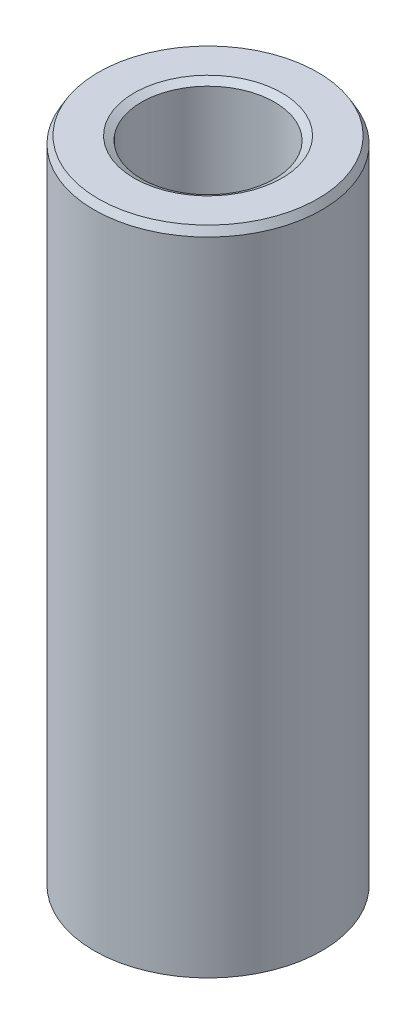
ISO-10303-21;
HEADER;
FILE_DESCRIPTION(('STEP AP214'),'2;1');
FILE_NAME('part.step','',(''),(''),'','','');
FILE_SCHEMA(('AUTOMOTIVE_DESIGN { 1 0 10303 214 1 1 1 1 }'));
ENDSEC;
DATA;
#1=APPLICATION_CONTEXT('core data for automotive mechanical design processes');
#2=APPLICATION_PROTOCOL_DEFINITION('international standard','automotive_design',2000,#1);
#3=PRODUCT_CONTEXT('',#1,'mechanical');
#4=PRODUCT('Part','Part','',(#3));
#5=PRODUCT_RELATED_PRODUCT_CATEGORY('part','',(#4));
#6=PRODUCT_DEFINITION_FORMATION('','',#4);
#7=PRODUCT_DEFINITION_CONTEXT('part definition',#1,'design');
#8=PRODUCT_DEFINITION('design','',#6,#7);
#9=PRODUCT_DEFINITION_SHAPE('','',#8);
#10=(LENGTH_UNIT() NAMED_UNIT(*) SI_UNIT(.MILLI.,.METRE.));
#11=(NAMED_UNIT(*) PLANE_ANGLE_UNIT() SI_UNIT($,.RADIAN.));
#12=(NAMED_UNIT(*) SI_UNIT($,.STERADIAN.) SOLID_ANGLE_UNIT());
#13=UNCERTAINTY_MEASURE_WITH_UNIT(LENGTH_MEASURE(1.E-05),#10,'distance_accuracy_value','');
#14=(GEOMETRIC_REPRESENTATION_CONTEXT(3) GLOBAL_UNCERTAINTY_ASSIGNED_CONTEXT((#13)) GLOBAL_UNIT_ASSIGNED_CONTEXT((#10,
#11,#12)) REPRESENTATION_CONTEXT('',''));
#15=CARTESIAN_POINT('',(0.,0.,0.));
#16=DIRECTION('',(0.,0.,1.));
#17=DIRECTION('',(1.,0.,0.));
#18=AXIS2_PLACEMENT_3D('',#15,#16,#17);
#19=CARTESIAN_POINT('',(0.,172.003541324737,0.));
#20=DIRECTION('',(0.,-1.,0.));
#21=DIRECTION('',(0.,0.,-1.));
#22=AXIS2_PLACEMENT_3D('',#19,#20,#21);
#23=CYLINDRICAL_SURFACE('',#22,30.);
#24=CARTESIAN_POINT('',(0.,1.12327016512606,0.));
#25=DIRECTION('',(0.,1.,0.));
#26=DIRECTION('',(0.,0.,1.));
#27=AXIS2_PLACEMENT_3D('',#24,#25,#26);
#28=CIRCLE('',#27,30.);
#29=CARTESIAN_POINT('',(0.,1.12327016512606,30.));
#30=VERTEX_POINT('',#29);
#31=EDGE_CURVE('E10',#30,#30,#28,.T.);
#32=ORIENTED_EDGE('',*,*,#31,.T.);
#33=EDGE_LOOP('',(#32));
#34=FACE_BOUND('',#33,.T.);
#35=CARTESIAN_POINT('',(0.,170.057980328112,0.));
#36=DIRECTION('',(0.,1.,0.));
#37=DIRECTION('',(0.,0.,1.));
#38=AXIS2_PLACEMENT_3D('',#35,#36,#37);
#39=CIRCLE('',#38,30.);
#40=CARTESIAN_POINT('',(0.,170.057980328112,30.));
#41=VERTEX_POINT('',#40);
#42=EDGE_CURVE('E50',#41,#41,#39,.F.);
#43=ORIENTED_EDGE('',*,*,#42,.T.);
#44=EDGE_LOOP('',(#43));
#45=FACE_BOUND('',#44,.T.);
#46=ADVANCED_FACE('F39',(#34,#45),#23,.T.);
#47=CARTESIAN_POINT('',(0.,172.003541324737,0.));
#48=DIRECTION('',(0.,1.,0.));
#49=DIRECTION('',(0.,0.,1.));
#50=AXIS2_PLACEMENT_3D('',#47,#48,#49);
#51=PLANE('',#50);
#52=CARTESIAN_POINT('',(0.,172.003541324737,0.));
#53=DIRECTION('',(0.,1.,0.));
#54=DIRECTION('',(0.,0.,1.));
#55=AXIS2_PLACEMENT_3D('',#52,#53,#54);
#56=CIRCLE('',#55,19.4596956766326);
#57=CARTESIAN_POINT('',(0.,172.003541324737,19.4596956766326));
#58=VERTEX_POINT('',#57);
#59=EDGE_CURVE('E58',#58,#58,#56,.F.);
#60=ORIENTED_EDGE('',*,*,#59,.T.);
#61=EDGE_LOOP('',(#60));
#62=FACE_BOUND('',#61,.T.);
#63=CARTESIAN_POINT('',(0.,172.003541324737,0.));
#64=DIRECTION('',(0.,1.,0.));
#65=DIRECTION('',(0.,0.,1.));
#66=AXIS2_PLACEMENT_3D('',#63,#64,#65);
#67=CIRCLE('',#66,28.8767298348739);
#68=CARTESIAN_POINT('',(0.,172.003541324737,28.8767298348739));
#69=VERTEX_POINT('',#68);
#70=EDGE_CURVE('E61',#69,#69,#67,.T.);
#71=ORIENTED_EDGE('',*,*,#70,.T.);
#72=EDGE_LOOP('',(#71));
#73=FACE_BOUND('',#72,.T.);
#74=ADVANCED_FACE('F88',(#62,#73),#51,.T.);
#75=CARTESIAN_POINT('',(0.,0.,0.));
#76=DIRECTION('',(0.,1.,0.));
#77=DIRECTION('',(0.,0.,1.));
#78=AXIS2_PLACEMENT_3D('',#75,#76,#77);
#79=PLANE('',#78);
#80=CARTESIAN_POINT('',(0.,0.,0.));
#81=DIRECTION('',(0.,1.,0.));
#82=DIRECTION('',(0.,0.,1.));
#83=AXIS2_PLACEMENT_3D('',#80,#81,#82);
#84=CIRCLE('',#83,18.6374048451341);
#85=CARTESIAN_POINT('',(0.,0.,18.6374048451341));
#86=VERTEX_POINT('',#85);
#87=EDGE_CURVE('E51',#86,#86,#84,.T.);
#88=ORIENTED_EDGE('',*,*,#87,.T.);
#89=EDGE_LOOP('',(#88));
#90=FACE_BOUND('',#89,.T.);
#91=CARTESIAN_POINT('',(0.,0.,0.));
#92=DIRECTION('',(0.,1.,0.));
#93=DIRECTION('',(0.,0.,1.));
#94=AXIS2_PLACEMENT_3D('',#91,#92,#93);
#95=CIRCLE('',#94,28.0544390033754);
#96=CARTESIAN_POINT('',(0.,0.,28.0544390033754));
#97=VERTEX_POINT('',#96);
#98=EDGE_CURVE('E54',#97,#97,#95,.F.);
#99=ORIENTED_EDGE('',*,*,#98,.T.);
#100=EDGE_LOOP('',(#99));
#101=FACE_BOUND('',#100,.T.);
#102=ADVANCED_FACE('F83',(#90,#101),#79,.F.);
#103=CARTESIAN_POINT('',(0.,172.003541324737,0.));
#104=DIRECTION('',(0.,-1.,0.));
#105=DIRECTION('',(0.,0.,-1.));
#106=AXIS2_PLACEMENT_3D('',#103,#104,#105);
#107=CYLINDRICAL_SURFACE('',#106,17.514134680008);
#108=CARTESIAN_POINT('',(0.,170.880271159611,0.));
#109=DIRECTION('',(0.,1.,0.));
#110=DIRECTION('',(0.,0.,1.));
#111=AXIS2_PLACEMENT_3D('',#108,#109,#110);
#112=CIRCLE('',#111,17.514134680008);
#113=CARTESIAN_POINT('',(0.,170.880271159611,17.514134680008));
#114=VERTEX_POINT('',#113);
#115=EDGE_CURVE('E67',#114,#114,#112,.T.);
#116=ORIENTED_EDGE('',*,*,#115,.T.);
#117=EDGE_LOOP('',(#116));
#118=FACE_BOUND('',#117,.T.);
#119=CARTESIAN_POINT('',(0.,1.94556099662466,0.));
#120=DIRECTION('',(0.,1.,0.));
#121=DIRECTION('',(0.,0.,1.));
#122=AXIS2_PLACEMENT_3D('',#119,#120,#121);
#123=CIRCLE('',#122,17.514134680008);
#124=CARTESIAN_POINT('',(0.,1.94556099662466,17.514134680008));
#125=VERTEX_POINT('',#124);
#126=EDGE_CURVE('E69',#125,#125,#123,.F.);
#127=ORIENTED_EDGE('',*,*,#126,.T.);
#128=EDGE_LOOP('',(#127));
#129=FACE_BOUND('',#128,.T.);
#130=ADVANCED_FACE('F71',(#118,#129),#107,.F.);
#131=CARTESIAN_POINT('',(0.,170.880271159611,0.));
#132=DIRECTION('',(0.,1.,0.));
#133=DIRECTION('',(0.,0.,1.));
#134=AXIS2_PLACEMENT_3D('',#131,#132,#133);
#135=CONICAL_SURFACE('',#134,17.514134680008,1.04719755119661);
#136=ORIENTED_EDGE('',*,*,#59,.F.);
#137=EDGE_LOOP('',(#136));
#138=FACE_BOUND('',#137,.T.);
#139=ORIENTED_EDGE('',*,*,#115,.F.);
#140=EDGE_LOOP('',(#139));
#141=FACE_BOUND('',#140,.T.);
#142=ADVANCED_FACE('F77',(#138,#141),#135,.F.);
#143=CARTESIAN_POINT('',(0.,0.,0.));
#144=DIRECTION('',(0.,-1.,0.));
#145=DIRECTION('',(0.,0.,-1.));
#146=AXIS2_PLACEMENT_3D('',#143,#144,#145);
#147=CONICAL_SURFACE('',#146,18.6374048451341,0.523598775598296);
#148=ORIENTED_EDGE('',*,*,#126,.F.);
#149=EDGE_LOOP('',(#148));
#150=FACE_BOUND('',#149,.T.);
#151=ORIENTED_EDGE('',*,*,#87,.F.);
#152=EDGE_LOOP('',(#151));
#153=FACE_BOUND('',#152,.T.);
#154=ADVANCED_FACE('F73',(#150,#153),#147,.F.);
#155=CARTESIAN_POINT('',(0.,1.12327016512606,0.));
#156=DIRECTION('',(0.,1.,0.));
#157=DIRECTION('',(0.,0.,1.));
#158=AXIS2_PLACEMENT_3D('',#155,#156,#157);
#159=CONICAL_SURFACE('',#158,30.,1.0471975511966);
#160=ORIENTED_EDGE('',*,*,#98,.F.);
#161=EDGE_LOOP('',(#160));
#162=FACE_BOUND('',#161,.T.);
#163=ORIENTED_EDGE('',*,*,#31,.F.);
#164=EDGE_LOOP('',(#163));
#165=FACE_BOUND('',#164,.T.);
#166=ADVANCED_FACE('F76',(#162,#165),#159,.T.);
#167=CARTESIAN_POINT('',(0.,172.003541324737,0.));
#168=DIRECTION('',(0.,-1.,0.));
#169=DIRECTION('',(0.,0.,-1.));
#170=AXIS2_PLACEMENT_3D('',#167,#168,#169);
#171=CONICAL_SURFACE('',#170,28.8767298348739,0.523598775598294);
#172=ORIENTED_EDGE('',*,*,#42,.F.);
#173=EDGE_LOOP('',(#172));
#174=FACE_BOUND('',#173,.T.);
#175=ORIENTED_EDGE('',*,*,#70,.F.);
#176=EDGE_LOOP('',(#175));
#177=FACE_BOUND('',#176,.T.);
#178=ADVANCED_FACE('F45',(#174,#177),#171,.T.);
#179=CLOSED_SHELL('',(#46,#74,#102,#130,#142,#154,#166,#178));
#180=MANIFOLD_SOLID_BREP('B2',#179);
#181=ADVANCED_BREP_SHAPE_REPRESENTATION('',(#18,#180),#14);
#182=SHAPE_DEFINITION_REPRESENTATION(#9,#181);
ENDSEC;
END-ISO-10303-21;
